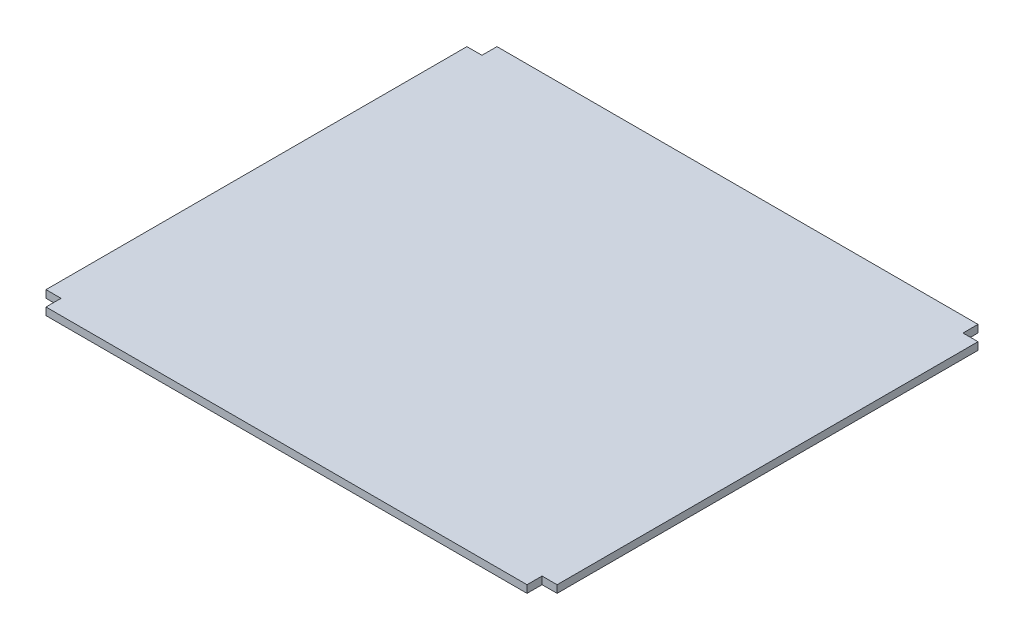
ISO-10303-21;
HEADER;
FILE_DESCRIPTION(('STEP AP214'),'2;1');
FILE_NAME('part.step','',(''),(''),'','','');
FILE_SCHEMA(('AUTOMOTIVE_DESIGN { 1 0 10303 214 1 1 1 1 }'));
ENDSEC;
DATA;
#1=APPLICATION_CONTEXT('core data for automotive mechanical design processes');
#2=APPLICATION_PROTOCOL_DEFINITION('international standard','automotive_design',2000,#1);
#3=PRODUCT_CONTEXT('',#1,'mechanical');
#4=PRODUCT('Part','Part','',(#3));
#5=PRODUCT_RELATED_PRODUCT_CATEGORY('part','',(#4));
#6=PRODUCT_DEFINITION_FORMATION('','',#4);
#7=PRODUCT_DEFINITION_CONTEXT('part definition',#1,'design');
#8=PRODUCT_DEFINITION('design','',#6,#7);
#9=PRODUCT_DEFINITION_SHAPE('','',#8);
#10=(LENGTH_UNIT() NAMED_UNIT(*) SI_UNIT(.MILLI.,.METRE.));
#11=(NAMED_UNIT(*) PLANE_ANGLE_UNIT() SI_UNIT($,.RADIAN.));
#12=(NAMED_UNIT(*) SI_UNIT($,.STERADIAN.) SOLID_ANGLE_UNIT());
#13=UNCERTAINTY_MEASURE_WITH_UNIT(LENGTH_MEASURE(1.E-05),#10,'distance_accuracy_value','');
#14=(GEOMETRIC_REPRESENTATION_CONTEXT(3) GLOBAL_UNCERTAINTY_ASSIGNED_CONTEXT((#13)) GLOBAL_UNIT_ASSIGNED_CONTEXT((#10,
#11,#12)) REPRESENTATION_CONTEXT('',''));
#15=CARTESIAN_POINT('',(0.,0.,0.));
#16=DIRECTION('',(0.,0.,1.));
#17=DIRECTION('',(1.,0.,0.));
#18=AXIS2_PLACEMENT_3D('',#15,#16,#17);
#19=CARTESIAN_POINT('',(-320.,10.,0.));
#20=DIRECTION('',(-1.,0.,0.));
#21=DIRECTION('',(0.,0.,1.));
#22=AXIS2_PLACEMENT_3D('',#19,#20,#21);
#23=PLANE('',#22);
#24=DIRECTION('',(0.,0.,-1.));
#25=VECTOR('',#24,1.);
#26=CARTESIAN_POINT('',(-320.,0.,0.));
#27=LINE('',#26,#25);
#28=CARTESIAN_POINT('',(-320.,0.,-280.));
#29=VERTEX_POINT('',#28);
#30=CARTESIAN_POINT('',(-320.,0.,-300.));
#31=VERTEX_POINT('',#30);
#32=EDGE_CURVE('E164',#29,#31,#27,.T.);
#33=ORIENTED_EDGE('',*,*,#32,.F.);
#34=DIRECTION('',(0.,-1.,0.));
#35=VECTOR('',#34,1.);
#36=CARTESIAN_POINT('',(-320.,10.,-280.));
#37=LINE('',#36,#35);
#38=CARTESIAN_POINT('',(-320.,10.,-280.));
#39=VERTEX_POINT('',#38);
#40=EDGE_CURVE('E11',#39,#29,#37,.T.);
#41=ORIENTED_EDGE('',*,*,#40,.F.);
#42=DIRECTION('',(0.,0.,-1.));
#43=VECTOR('',#42,1.);
#44=CARTESIAN_POINT('',(-320.,10.,0.));
#45=LINE('',#44,#43);
#46=CARTESIAN_POINT('',(-320.,10.,-300.));
#47=VERTEX_POINT('',#46);
#48=EDGE_CURVE('E206',#39,#47,#45,.T.);
#49=ORIENTED_EDGE('',*,*,#48,.T.);
#50=DIRECTION('',(0.,-1.,0.));
#51=VECTOR('',#50,1.);
#52=CARTESIAN_POINT('',(-320.,10.,-300.));
#53=LINE('',#52,#51);
#54=EDGE_CURVE('E60',#47,#31,#53,.T.);
#55=ORIENTED_EDGE('',*,*,#54,.T.);
#56=EDGE_LOOP('',(#33,#41,#49,#55));
#57=FACE_BOUND('',#56,.T.);
#58=ADVANCED_FACE('F43',(#57),#23,.T.);
#59=CARTESIAN_POINT('',(0.,10.,-280.));
#60=DIRECTION('',(0.,0.,-1.));
#61=DIRECTION('',(-1.,0.,0.));
#62=AXIS2_PLACEMENT_3D('',#59,#60,#61);
#63=PLANE('',#62);
#64=DIRECTION('',(1.,0.,0.));
#65=VECTOR('',#64,1.);
#66=CARTESIAN_POINT('',(0.,0.,-280.));
#67=LINE('',#66,#65);
#68=CARTESIAN_POINT('',(-340.,0.,-280.));
#69=VERTEX_POINT('',#68);
#70=EDGE_CURVE('E167',#69,#29,#67,.T.);
#71=ORIENTED_EDGE('',*,*,#70,.F.);
#72=DIRECTION('',(0.,-1.,0.));
#73=VECTOR('',#72,1.);
#74=CARTESIAN_POINT('',(-340.,10.,-280.));
#75=LINE('',#74,#73);
#76=CARTESIAN_POINT('',(-340.,10.,-280.));
#77=VERTEX_POINT('',#76);
#78=EDGE_CURVE('E52',#77,#69,#75,.T.);
#79=ORIENTED_EDGE('',*,*,#78,.F.);
#80=DIRECTION('',(1.,0.,0.));
#81=VECTOR('',#80,1.);
#82=CARTESIAN_POINT('',(0.,10.,-280.));
#83=LINE('',#82,#81);
#84=EDGE_CURVE('E247',#77,#39,#83,.T.);
#85=ORIENTED_EDGE('',*,*,#84,.T.);
#86=ORIENTED_EDGE('',*,*,#40,.T.);
#87=EDGE_LOOP('',(#71,#79,#85,#86));
#88=FACE_BOUND('',#87,.T.);
#89=ADVANCED_FACE('F246',(#88),#63,.T.);
#90=CARTESIAN_POINT('',(-340.,10.,0.));
#91=DIRECTION('',(1.,0.,0.));
#92=DIRECTION('',(0.,0.,-1.));
#93=AXIS2_PLACEMENT_3D('',#90,#91,#92);
#94=PLANE('',#93);
#95=DIRECTION('',(0.,0.,1.));
#96=VECTOR('',#95,1.);
#97=CARTESIAN_POINT('',(-340.,0.,0.));
#98=LINE('',#97,#96);
#99=CARTESIAN_POINT('',(-340.,0.,280.));
#100=VERTEX_POINT('',#99);
#101=EDGE_CURVE('E171',#69,#100,#98,.T.);
#102=ORIENTED_EDGE('',*,*,#101,.T.);
#103=DIRECTION('',(0.,-1.,0.));
#104=VECTOR('',#103,1.);
#105=CARTESIAN_POINT('',(-340.,10.,280.));
#106=LINE('',#105,#104);
#107=CARTESIAN_POINT('',(-340.,10.,280.));
#108=VERTEX_POINT('',#107);
#109=EDGE_CURVE('E230',#108,#100,#106,.T.);
#110=ORIENTED_EDGE('',*,*,#109,.F.);
#111=DIRECTION('',(0.,0.,1.));
#112=VECTOR('',#111,1.);
#113=CARTESIAN_POINT('',(-340.,10.,0.));
#114=LINE('',#113,#112);
#115=EDGE_CURVE('E238',#77,#108,#114,.T.);
#116=ORIENTED_EDGE('',*,*,#115,.F.);
#117=ORIENTED_EDGE('',*,*,#78,.T.);
#118=EDGE_LOOP('',(#102,#110,#116,#117));
#119=FACE_BOUND('',#118,.T.);
#120=ADVANCED_FACE('F236',(#119),#94,.F.);
#121=CARTESIAN_POINT('',(7.77156117237608E-13,10.,279.999999999999));
#122=DIRECTION('',(0.,0.,1.));
#123=DIRECTION('',(1.,0.,0.));
#124=AXIS2_PLACEMENT_3D('',#121,#122,#123);
#125=PLANE('',#124);
#126=DIRECTION('',(-1.,0.,0.));
#127=VECTOR('',#126,1.);
#128=CARTESIAN_POINT('',(7.77156117237608E-13,0.,279.999999999999));
#129=LINE('',#128,#127);
#130=CARTESIAN_POINT('',(-320.,0.,280.));
#131=VERTEX_POINT('',#130);
#132=EDGE_CURVE('E175',#131,#100,#129,.T.);
#133=ORIENTED_EDGE('',*,*,#132,.F.);
#134=DIRECTION('',(0.,-1.,0.));
#135=VECTOR('',#134,1.);
#136=CARTESIAN_POINT('',(-320.,10.,280.));
#137=LINE('',#136,#135);
#138=CARTESIAN_POINT('',(-320.,10.,280.));
#139=VERTEX_POINT('',#138);
#140=EDGE_CURVE('E227',#139,#131,#137,.T.);
#141=ORIENTED_EDGE('',*,*,#140,.F.);
#142=DIRECTION('',(-1.,0.,0.));
#143=VECTOR('',#142,1.);
#144=CARTESIAN_POINT('',(7.77156117237608E-13,10.,279.999999999999));
#145=LINE('',#144,#143);
#146=EDGE_CURVE('E418',#139,#108,#145,.T.);
#147=ORIENTED_EDGE('',*,*,#146,.T.);
#148=ORIENTED_EDGE('',*,*,#109,.T.);
#149=EDGE_LOOP('',(#133,#141,#147,#148));
#150=FACE_BOUND('',#149,.T.);
#151=ADVANCED_FACE('F265',(#150),#125,.T.);
#152=CARTESIAN_POINT('',(-320.,10.,0.));
#153=DIRECTION('',(-1.,0.,0.));
#154=DIRECTION('',(0.,0.,1.));
#155=AXIS2_PLACEMENT_3D('',#152,#153,#154);
#156=PLANE('',#155);
#157=DIRECTION('',(0.,0.,-1.));
#158=VECTOR('',#157,1.);
#159=CARTESIAN_POINT('',(-320.,0.,0.));
#160=LINE('',#159,#158);
#161=CARTESIAN_POINT('',(-320.,0.,300.));
#162=VERTEX_POINT('',#161);
#163=EDGE_CURVE('E179',#162,#131,#160,.T.);
#164=ORIENTED_EDGE('',*,*,#163,.F.);
#165=DIRECTION('',(0.,-1.,0.));
#166=VECTOR('',#165,1.);
#167=CARTESIAN_POINT('',(-320.,10.,300.));
#168=LINE('',#167,#166);
#169=CARTESIAN_POINT('',(-320.,10.,300.));
#170=VERTEX_POINT('',#169);
#171=EDGE_CURVE('E224',#170,#162,#168,.T.);
#172=ORIENTED_EDGE('',*,*,#171,.F.);
#173=DIRECTION('',(0.,0.,-1.));
#174=VECTOR('',#173,1.);
#175=CARTESIAN_POINT('',(-320.,10.,0.));
#176=LINE('',#175,#174);
#177=EDGE_CURVE('E415',#170,#139,#176,.T.);
#178=ORIENTED_EDGE('',*,*,#177,.T.);
#179=ORIENTED_EDGE('',*,*,#140,.T.);
#180=EDGE_LOOP('',(#164,#172,#178,#179));
#181=FACE_BOUND('',#180,.T.);
#182=ADVANCED_FACE('F270',(#181),#156,.T.);
#183=CARTESIAN_POINT('',(0.,10.,300.));
#184=DIRECTION('',(0.,0.,-1.));
#185=DIRECTION('',(-1.,0.,0.));
#186=AXIS2_PLACEMENT_3D('',#183,#184,#185);
#187=PLANE('',#186);
#188=DIRECTION('',(1.,0.,0.));
#189=VECTOR('',#188,1.);
#190=CARTESIAN_POINT('',(0.,0.,300.));
#191=LINE('',#190,#189);
#192=CARTESIAN_POINT('',(320.,0.,300.));
#193=VERTEX_POINT('',#192);
#194=EDGE_CURVE('E183',#162,#193,#191,.T.);
#195=ORIENTED_EDGE('',*,*,#194,.T.);
#196=DIRECTION('',(0.,-1.,0.));
#197=VECTOR('',#196,1.);
#198=CARTESIAN_POINT('',(320.,10.,300.));
#199=LINE('',#198,#197);
#200=CARTESIAN_POINT('',(320.,10.,300.));
#201=VERTEX_POINT('',#200);
#202=EDGE_CURVE('E220',#201,#193,#199,.T.);
#203=ORIENTED_EDGE('',*,*,#202,.F.);
#204=DIRECTION('',(1.,0.,0.));
#205=VECTOR('',#204,1.);
#206=CARTESIAN_POINT('',(0.,10.,300.));
#207=LINE('',#206,#205);
#208=EDGE_CURVE('E411',#170,#201,#207,.T.);
#209=ORIENTED_EDGE('',*,*,#208,.F.);
#210=ORIENTED_EDGE('',*,*,#171,.T.);
#211=EDGE_LOOP('',(#195,#203,#209,#210));
#212=FACE_BOUND('',#211,.T.);
#213=ADVANCED_FACE('F274',(#212),#187,.F.);
#214=CARTESIAN_POINT('',(320.,10.,0.));
#215=DIRECTION('',(-1.,0.,0.));
#216=DIRECTION('',(0.,0.,1.));
#217=AXIS2_PLACEMENT_3D('',#214,#215,#216);
#218=PLANE('',#217);
#219=DIRECTION('',(0.,0.,-1.));
#220=VECTOR('',#219,1.);
#221=CARTESIAN_POINT('',(320.,0.,0.));
#222=LINE('',#221,#220);
#223=CARTESIAN_POINT('',(320.,0.,280.));
#224=VERTEX_POINT('',#223);
#225=EDGE_CURVE('E186',#193,#224,#222,.T.);
#226=ORIENTED_EDGE('',*,*,#225,.T.);
#227=DIRECTION('',(0.,-1.,0.));
#228=VECTOR('',#227,1.);
#229=CARTESIAN_POINT('',(320.,10.,280.));
#230=LINE('',#229,#228);
#231=CARTESIAN_POINT('',(320.,10.,280.));
#232=VERTEX_POINT('',#231);
#233=EDGE_CURVE('E216',#232,#224,#230,.T.);
#234=ORIENTED_EDGE('',*,*,#233,.F.);
#235=DIRECTION('',(0.,0.,-1.));
#236=VECTOR('',#235,1.);
#237=CARTESIAN_POINT('',(320.,10.,0.));
#238=LINE('',#237,#236);
#239=EDGE_CURVE('E408',#201,#232,#238,.T.);
#240=ORIENTED_EDGE('',*,*,#239,.F.);
#241=ORIENTED_EDGE('',*,*,#202,.T.);
#242=EDGE_LOOP('',(#226,#234,#240,#241));
#243=FACE_BOUND('',#242,.T.);
#244=ADVANCED_FACE('F278',(#243),#218,.F.);
#245=CARTESIAN_POINT('',(-7.77156117237606E-13,10.,279.999999999999));
#246=DIRECTION('',(0.,0.,-1.));
#247=DIRECTION('',(-1.,0.,0.));
#248=AXIS2_PLACEMENT_3D('',#245,#246,#247);
#249=PLANE('',#248);
#250=DIRECTION('',(1.,0.,0.));
#251=VECTOR('',#250,1.);
#252=CARTESIAN_POINT('',(-7.77156117237606E-13,0.,279.999999999999));
#253=LINE('',#252,#251);
#254=CARTESIAN_POINT('',(340.,0.,280.));
#255=VERTEX_POINT('',#254);
#256=EDGE_CURVE('E189',#224,#255,#253,.T.);
#257=ORIENTED_EDGE('',*,*,#256,.T.);
#258=DIRECTION('',(0.,-1.,0.));
#259=VECTOR('',#258,1.);
#260=CARTESIAN_POINT('',(340.,10.,280.));
#261=LINE('',#260,#259);
#262=CARTESIAN_POINT('',(340.,10.,280.));
#263=VERTEX_POINT('',#262);
#264=EDGE_CURVE('E213',#263,#255,#261,.T.);
#265=ORIENTED_EDGE('',*,*,#264,.F.);
#266=DIRECTION('',(1.,0.,0.));
#267=VECTOR('',#266,1.);
#268=CARTESIAN_POINT('',(-7.77156117237606E-13,10.,279.999999999999));
#269=LINE('',#268,#267);
#270=EDGE_CURVE('E406',#232,#263,#269,.T.);
#271=ORIENTED_EDGE('',*,*,#270,.F.);
#272=ORIENTED_EDGE('',*,*,#233,.T.);
#273=EDGE_LOOP('',(#257,#265,#271,#272));
#274=FACE_BOUND('',#273,.T.);
#275=ADVANCED_FACE('F282',(#274),#249,.F.);
#276=CARTESIAN_POINT('',(340.,10.,0.));
#277=DIRECTION('',(1.,0.,0.));
#278=DIRECTION('',(0.,0.,-1.));
#279=AXIS2_PLACEMENT_3D('',#276,#277,#278);
#280=PLANE('',#279);
#281=DIRECTION('',(0.,0.,1.));
#282=VECTOR('',#281,1.);
#283=CARTESIAN_POINT('',(340.,0.,0.));
#284=LINE('',#283,#282);
#285=CARTESIAN_POINT('',(340.,0.,-280.));
#286=VERTEX_POINT('',#285);
#287=EDGE_CURVE('E193',#286,#255,#284,.T.);
#288=ORIENTED_EDGE('',*,*,#287,.F.);
#289=DIRECTION('',(0.,-1.,0.));
#290=VECTOR('',#289,1.);
#291=CARTESIAN_POINT('',(340.,10.,-280.));
#292=LINE('',#291,#290);
#293=CARTESIAN_POINT('',(340.,10.,-280.));
#294=VERTEX_POINT('',#293);
#295=EDGE_CURVE('E144',#294,#286,#292,.T.);
#296=ORIENTED_EDGE('',*,*,#295,.F.);
#297=DIRECTION('',(0.,0.,1.));
#298=VECTOR('',#297,1.);
#299=CARTESIAN_POINT('',(340.,10.,0.));
#300=LINE('',#299,#298);
#301=EDGE_CURVE('E153',#294,#263,#300,.T.);
#302=ORIENTED_EDGE('',*,*,#301,.T.);
#303=ORIENTED_EDGE('',*,*,#264,.T.);
#304=EDGE_LOOP('',(#288,#296,#302,#303));
#305=FACE_BOUND('',#304,.T.);
#306=ADVANCED_FACE('F286',(#305),#280,.T.);
#307=CARTESIAN_POINT('',(0.,10.,-280.));
#308=DIRECTION('',(0.,0.,-1.));
#309=DIRECTION('',(-1.,0.,0.));
#310=AXIS2_PLACEMENT_3D('',#307,#308,#309);
#311=PLANE('',#310);
#312=DIRECTION('',(1.,0.,0.));
#313=VECTOR('',#312,1.);
#314=CARTESIAN_POINT('',(0.,0.,-280.));
#315=LINE('',#314,#313);
#316=CARTESIAN_POINT('',(320.,0.,-280.));
#317=VERTEX_POINT('',#316);
#318=EDGE_CURVE('E139',#317,#286,#315,.T.);
#319=ORIENTED_EDGE('',*,*,#318,.F.);
#320=DIRECTION('',(0.,-1.,0.));
#321=VECTOR('',#320,1.);
#322=CARTESIAN_POINT('',(320.,10.,-280.));
#323=LINE('',#322,#321);
#324=CARTESIAN_POINT('',(320.,10.,-280.));
#325=VERTEX_POINT('',#324);
#326=EDGE_CURVE('E134',#325,#317,#323,.T.);
#327=ORIENTED_EDGE('',*,*,#326,.F.);
#328=DIRECTION('',(1.,0.,0.));
#329=VECTOR('',#328,1.);
#330=CARTESIAN_POINT('',(0.,10.,-280.));
#331=LINE('',#330,#329);
#332=EDGE_CURVE('E137',#325,#294,#331,.T.);
#333=ORIENTED_EDGE('',*,*,#332,.T.);
#334=ORIENTED_EDGE('',*,*,#295,.T.);
#335=EDGE_LOOP('',(#319,#327,#333,#334));
#336=FACE_BOUND('',#335,.T.);
#337=ADVANCED_FACE('F136',(#336),#311,.T.);
#338=CARTESIAN_POINT('',(320.,10.,0.));
#339=DIRECTION('',(1.,0.,0.));
#340=DIRECTION('',(0.,0.,-1.));
#341=AXIS2_PLACEMENT_3D('',#338,#339,#340);
#342=PLANE('',#341);
#343=DIRECTION('',(0.,0.,1.));
#344=VECTOR('',#343,1.);
#345=CARTESIAN_POINT('',(320.,0.,0.));
#346=LINE('',#345,#344);
#347=CARTESIAN_POINT('',(320.,0.,-300.));
#348=VERTEX_POINT('',#347);
#349=EDGE_CURVE('E199',#348,#317,#346,.T.);
#350=ORIENTED_EDGE('',*,*,#349,.F.);
#351=DIRECTION('',(0.,-1.,0.));
#352=VECTOR('',#351,1.);
#353=CARTESIAN_POINT('',(320.,10.,-300.));
#354=LINE('',#353,#352);
#355=CARTESIAN_POINT('',(320.,10.,-300.));
#356=VERTEX_POINT('',#355);
#357=EDGE_CURVE('E97',#356,#348,#354,.T.);
#358=ORIENTED_EDGE('',*,*,#357,.F.);
#359=DIRECTION('',(0.,0.,1.));
#360=VECTOR('',#359,1.);
#361=CARTESIAN_POINT('',(320.,10.,0.));
#362=LINE('',#361,#360);
#363=EDGE_CURVE('E151',#356,#325,#362,.T.);
#364=ORIENTED_EDGE('',*,*,#363,.T.);
#365=ORIENTED_EDGE('',*,*,#326,.T.);
#366=EDGE_LOOP('',(#350,#358,#364,#365));
#367=FACE_BOUND('',#366,.T.);
#368=ADVANCED_FACE('F156',(#367),#342,.T.);
#369=CARTESIAN_POINT('',(0.,10.,-300.));
#370=DIRECTION('',(0.,0.,-1.));
#371=DIRECTION('',(-1.,0.,0.));
#372=AXIS2_PLACEMENT_3D('',#369,#370,#371);
#373=PLANE('',#372);
#374=DIRECTION('',(1.,0.,0.));
#375=VECTOR('',#374,1.);
#376=CARTESIAN_POINT('',(0.,0.,-300.));
#377=LINE('',#376,#375);
#378=EDGE_CURVE('E202',#31,#348,#377,.T.);
#379=ORIENTED_EDGE('',*,*,#378,.F.);
#380=ORIENTED_EDGE('',*,*,#54,.F.);
#381=DIRECTION('',(1.,0.,0.));
#382=VECTOR('',#381,1.);
#383=CARTESIAN_POINT('',(0.,10.,-300.));
#384=LINE('',#383,#382);
#385=EDGE_CURVE('E158',#47,#356,#384,.T.);
#386=ORIENTED_EDGE('',*,*,#385,.T.);
#387=ORIENTED_EDGE('',*,*,#357,.T.);
#388=EDGE_LOOP('',(#379,#380,#386,#387));
#389=FACE_BOUND('',#388,.T.);
#390=ADVANCED_FACE('F248',(#389),#373,.T.);
#391=CARTESIAN_POINT('',(0.,10.,0.));
#392=DIRECTION('',(0.,1.,0.));
#393=DIRECTION('',(0.,0.,1.));
#394=AXIS2_PLACEMENT_3D('',#391,#392,#393);
#395=PLANE('',#394);
#396=ORIENTED_EDGE('',*,*,#48,.F.);
#397=ORIENTED_EDGE('',*,*,#84,.F.);
#398=ORIENTED_EDGE('',*,*,#115,.T.);
#399=ORIENTED_EDGE('',*,*,#146,.F.);
#400=ORIENTED_EDGE('',*,*,#177,.F.);
#401=ORIENTED_EDGE('',*,*,#208,.T.);
#402=ORIENTED_EDGE('',*,*,#239,.T.);
#403=ORIENTED_EDGE('',*,*,#270,.T.);
#404=ORIENTED_EDGE('',*,*,#301,.F.);
#405=ORIENTED_EDGE('',*,*,#332,.F.);
#406=ORIENTED_EDGE('',*,*,#363,.F.);
#407=ORIENTED_EDGE('',*,*,#385,.F.);
#408=EDGE_LOOP('',(#396,#397,#398,#399,#400,#401,#402,#403,#404,#405,#406,#407));
#409=FACE_BOUND('',#408,.T.);
#410=ADVANCED_FACE('F149',(#409),#395,.T.);
#411=CARTESIAN_POINT('',(0.,0.,0.));
#412=DIRECTION('',(0.,1.,0.));
#413=DIRECTION('',(0.,0.,1.));
#414=AXIS2_PLACEMENT_3D('',#411,#412,#413);
#415=PLANE('',#414);
#416=ORIENTED_EDGE('',*,*,#32,.T.);
#417=ORIENTED_EDGE('',*,*,#378,.T.);
#418=ORIENTED_EDGE('',*,*,#349,.T.);
#419=ORIENTED_EDGE('',*,*,#318,.T.);
#420=ORIENTED_EDGE('',*,*,#287,.T.);
#421=ORIENTED_EDGE('',*,*,#256,.F.);
#422=ORIENTED_EDGE('',*,*,#225,.F.);
#423=ORIENTED_EDGE('',*,*,#194,.F.);
#424=ORIENTED_EDGE('',*,*,#163,.T.);
#425=ORIENTED_EDGE('',*,*,#132,.T.);
#426=ORIENTED_EDGE('',*,*,#101,.F.);
#427=ORIENTED_EDGE('',*,*,#70,.T.);
#428=EDGE_LOOP('',(#416,#417,#418,#419,#420,#421,#422,#423,#424,#425,#426,#427));
#429=FACE_BOUND('',#428,.T.);
#430=ADVANCED_FACE('F244',(#429),#415,.F.);
#431=CLOSED_SHELL('',(#58,#89,#120,#151,#182,#213,#244,#275,#306,#337,#368,#390,#410,#430));
#432=MANIFOLD_SOLID_BREP('B2',#431);
#433=ADVANCED_BREP_SHAPE_REPRESENTATION('',(#18,#432),#14);
#434=SHAPE_DEFINITION_REPRESENTATION(#9,#433);
ENDSEC;
END-ISO-10303-21;
